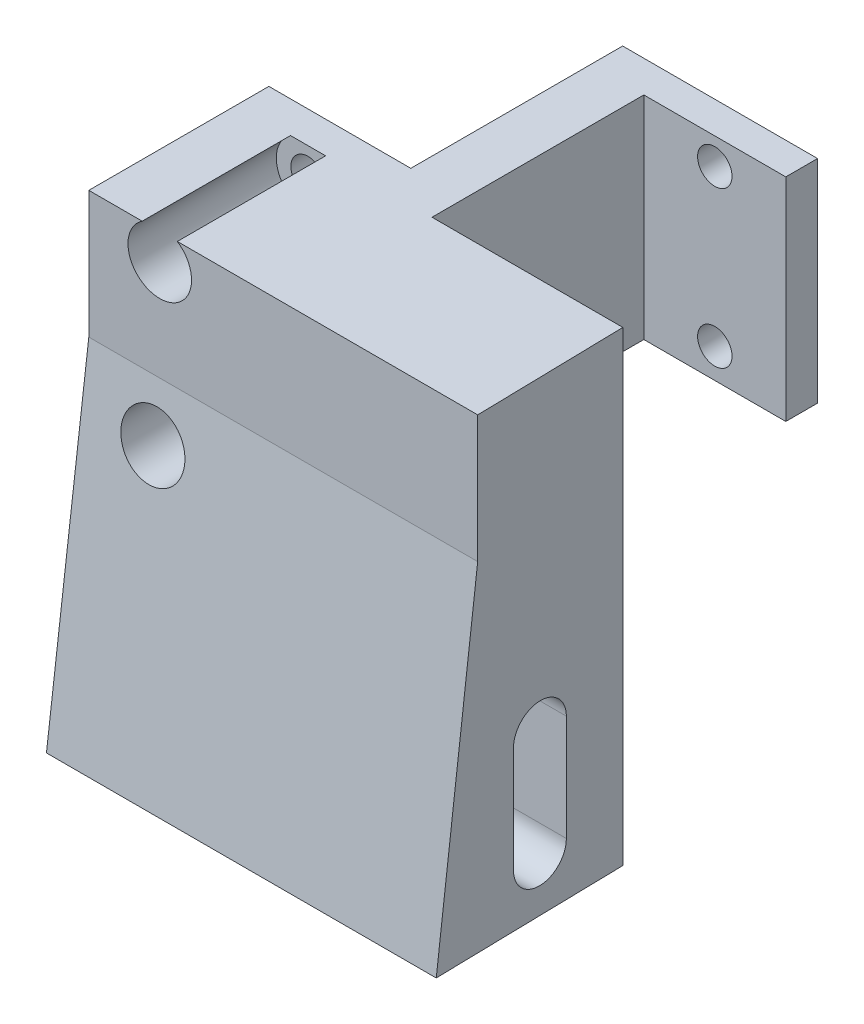
ISO-10303-21;
HEADER;
FILE_DESCRIPTION(('STEP AP214'),'2;1');
FILE_NAME('part.step','',(''),(''),'','','');
FILE_SCHEMA(('AUTOMOTIVE_DESIGN { 1 0 10303 214 1 1 1 1 }'));
ENDSEC;
DATA;
#1=APPLICATION_CONTEXT('core data for automotive mechanical design processes');
#2=APPLICATION_PROTOCOL_DEFINITION('international standard','automotive_design',2000,#1);
#3=PRODUCT_CONTEXT('',#1,'mechanical');
#4=PRODUCT('Part','Part','',(#3));
#5=PRODUCT_RELATED_PRODUCT_CATEGORY('part','',(#4));
#6=PRODUCT_DEFINITION_FORMATION('','',#4);
#7=PRODUCT_DEFINITION_CONTEXT('part definition',#1,'design');
#8=PRODUCT_DEFINITION('design','',#6,#7);
#9=PRODUCT_DEFINITION_SHAPE('','',#8);
#10=(LENGTH_UNIT() NAMED_UNIT(*) SI_UNIT(.MILLI.,.METRE.));
#11=(NAMED_UNIT(*) PLANE_ANGLE_UNIT() SI_UNIT($,.RADIAN.));
#12=(NAMED_UNIT(*) SI_UNIT($,.STERADIAN.) SOLID_ANGLE_UNIT());
#13=UNCERTAINTY_MEASURE_WITH_UNIT(LENGTH_MEASURE(1.E-05),#10,'distance_accuracy_value','');
#14=(GEOMETRIC_REPRESENTATION_CONTEXT(3) GLOBAL_UNCERTAINTY_ASSIGNED_CONTEXT((#13)) GLOBAL_UNIT_ASSIGNED_CONTEXT((#10,
#11,#12)) REPRESENTATION_CONTEXT('',''));
#15=CARTESIAN_POINT('',(0.,0.,0.));
#16=DIRECTION('',(0.,0.,1.));
#17=DIRECTION('',(1.,0.,0.));
#18=AXIS2_PLACEMENT_3D('',#15,#16,#17);
#19=CARTESIAN_POINT('',(89.3394572960189,-9.,7.99999999999999));
#20=DIRECTION('',(-1.,0.,0.));
#21=DIRECTION('',(0.,0.,1.));
#22=AXIS2_PLACEMENT_3D('',#19,#20,#21);
#23=CYLINDRICAL_SURFACE('',#22,2.55);
#24=CARTESIAN_POINT('',(31.5859039495124,-9.,8.));
#25=DIRECTION('',(-0.999773312281266,0.,0.021291407894867));
#26=DIRECTION('',(-0.021291407894867,0.,-0.999773312281266));
#27=AXIS2_PLACEMENT_3D('',#24,#25,#26);
#28=ELLIPSE('',#27,2.55057818475015,2.55);
#29=CARTESIAN_POINT('',(31.5315985490131,-9.,5.45));
#30=VERTEX_POINT('',#29);
#31=CARTESIAN_POINT('',(31.6402093500117,-9.,10.55));
#32=VERTEX_POINT('',#31);
#33=EDGE_CURVE('E371',#30,#32,#28,.F.);
#34=ORIENTED_EDGE('',*,*,#33,.F.);
#35=DIRECTION('',(-1.,0.,0.));
#36=VECTOR('',#35,1.);
#37=CARTESIAN_POINT('',(89.3394572960189,-9.,5.45));
#38=LINE('',#37,#36);
#39=CARTESIAN_POINT('',(36.5327322446017,-9.,5.45));
#40=VERTEX_POINT('',#39);
#41=EDGE_CURVE('E326',#40,#30,#38,.T.);
#42=ORIENTED_EDGE('',*,*,#41,.F.);
#43=CARTESIAN_POINT('',(36.5870376451009,-9.,8.));
#44=DIRECTION('',(-0.999773312281266,0.,0.021291407894867));
#45=DIRECTION('',(-0.021291407894867,0.,-0.999773312281266));
#46=AXIS2_PLACEMENT_3D('',#43,#44,#45);
#47=ELLIPSE('',#46,2.55057818475015,2.55);
#48=CARTESIAN_POINT('',(36.6413430456002,-9.,10.55));
#49=VERTEX_POINT('',#48);
#50=EDGE_CURVE('E331',#40,#49,#47,.F.);
#51=ORIENTED_EDGE('',*,*,#50,.T.);
#52=DIRECTION('',(-1.,0.,0.));
#53=VECTOR('',#52,1.);
#54=CARTESIAN_POINT('',(89.3394572960189,-9.,10.55));
#55=LINE('',#54,#53);
#56=EDGE_CURVE('E325',#49,#32,#55,.T.);
#57=ORIENTED_EDGE('',*,*,#56,.T.);
#58=EDGE_LOOP('',(#34,#42,#51,#57));
#59=FACE_BOUND('',#58,.T.);
#60=ADVANCED_FACE('F45',(#59),#23,.F.);
#61=CARTESIAN_POINT('',(89.3394572960189,-9.,10.55));
#62=DIRECTION('',(0.,0.,1.));
#63=DIRECTION('',(0.,-1.,0.));
#64=AXIS2_PLACEMENT_3D('',#61,#62,#63);
#65=PLANE('',#64);
#66=DIRECTION('',(0.,-1.,0.));
#67=VECTOR('',#66,1.);
#68=CARTESIAN_POINT('',(31.6402093500117,-9.,10.55));
#69=LINE('',#68,#67);
#70=CARTESIAN_POINT('',(31.6402093500117,-19.,10.55));
#71=VERTEX_POINT('',#70);
#72=EDGE_CURVE('E377',#32,#71,#69,.T.);
#73=ORIENTED_EDGE('',*,*,#72,.F.);
#74=ORIENTED_EDGE('',*,*,#56,.F.);
#75=DIRECTION('',(0.,-1.,0.));
#76=VECTOR('',#75,1.);
#77=CARTESIAN_POINT('',(36.6413430456002,-9.,10.55));
#78=LINE('',#77,#76);
#79=CARTESIAN_POINT('',(36.6413430456002,-19.,10.55));
#80=VERTEX_POINT('',#79);
#81=EDGE_CURVE('E345',#49,#80,#78,.T.);
#82=ORIENTED_EDGE('',*,*,#81,.T.);
#83=DIRECTION('',(-1.,0.,0.));
#84=VECTOR('',#83,1.);
#85=CARTESIAN_POINT('',(89.3394572960189,-19.,10.55));
#86=LINE('',#85,#84);
#87=EDGE_CURVE('E335',#80,#71,#86,.T.);
#88=ORIENTED_EDGE('',*,*,#87,.T.);
#89=EDGE_LOOP('',(#73,#74,#82,#88));
#90=FACE_BOUND('',#89,.T.);
#91=ADVANCED_FACE('F546',(#90),#65,.F.);
#92=CARTESIAN_POINT('',(89.3394572960189,-19.,8.));
#93=DIRECTION('',(-1.,0.,0.));
#94=DIRECTION('',(0.,0.,1.));
#95=AXIS2_PLACEMENT_3D('',#92,#93,#94);
#96=CYLINDRICAL_SURFACE('',#95,2.55);
#97=CARTESIAN_POINT('',(31.5859039495124,-19.,8.));
#98=DIRECTION('',(-0.999773312281266,0.,0.021291407894867));
#99=DIRECTION('',(-0.021291407894867,0.,-0.999773312281266));
#100=AXIS2_PLACEMENT_3D('',#97,#98,#99);
#101=ELLIPSE('',#100,2.55057818475015,2.55);
#102=CARTESIAN_POINT('',(31.5315985490131,-19.,5.45));
#103=VERTEX_POINT('',#102);
#104=EDGE_CURVE('E380',#71,#103,#101,.F.);
#105=ORIENTED_EDGE('',*,*,#104,.F.);
#106=ORIENTED_EDGE('',*,*,#87,.F.);
#107=CARTESIAN_POINT('',(36.5870376451009,-19.,8.));
#108=DIRECTION('',(-0.999773312281266,0.,0.021291407894867));
#109=DIRECTION('',(-0.021291407894867,0.,-0.999773312281266));
#110=AXIS2_PLACEMENT_3D('',#107,#108,#109);
#111=ELLIPSE('',#110,2.55057818475015,2.55);
#112=CARTESIAN_POINT('',(36.5327322446017,-19.,5.45));
#113=VERTEX_POINT('',#112);
#114=EDGE_CURVE('E349',#80,#113,#111,.F.);
#115=ORIENTED_EDGE('',*,*,#114,.T.);
#116=DIRECTION('',(-1.,0.,0.));
#117=VECTOR('',#116,1.);
#118=CARTESIAN_POINT('',(89.3394572960189,-19.,5.44999999999999));
#119=LINE('',#118,#117);
#120=EDGE_CURVE('E330',#113,#103,#119,.T.);
#121=ORIENTED_EDGE('',*,*,#120,.T.);
#122=EDGE_LOOP('',(#105,#106,#115,#121));
#123=FACE_BOUND('',#122,.T.);
#124=ADVANCED_FACE('F552',(#123),#96,.F.);
#125=CARTESIAN_POINT('',(89.3394572960189,-9.,5.45));
#126=DIRECTION('',(0.,0.,-1.));
#127=DIRECTION('',(0.,1.,0.));
#128=AXIS2_PLACEMENT_3D('',#125,#126,#127);
#129=PLANE('',#128);
#130=DIRECTION('',(0.,1.,0.));
#131=VECTOR('',#130,1.);
#132=CARTESIAN_POINT('',(31.5315985490131,-9.,5.45));
#133=LINE('',#132,#131);
#134=EDGE_CURVE('E383',#103,#30,#133,.T.);
#135=ORIENTED_EDGE('',*,*,#134,.F.);
#136=ORIENTED_EDGE('',*,*,#120,.F.);
#137=DIRECTION('',(0.,1.,0.));
#138=VECTOR('',#137,1.);
#139=CARTESIAN_POINT('',(36.5327322446017,-9.,5.45));
#140=LINE('',#139,#138);
#141=EDGE_CURVE('E353',#113,#40,#140,.T.);
#142=ORIENTED_EDGE('',*,*,#141,.T.);
#143=ORIENTED_EDGE('',*,*,#41,.T.);
#144=EDGE_LOOP('',(#135,#136,#142,#143));
#145=FACE_BOUND('',#144,.T.);
#146=ADVANCED_FACE('F558',(#145),#129,.F.);
#147=CARTESIAN_POINT('',(0.,20.,-3.));
#148=DIRECTION('',(1.,0.,0.));
#149=DIRECTION('',(0.,0.,-1.));
#150=AXIS2_PLACEMENT_3D('',#147,#148,#149);
#151=PLANE('',#150);
#152=CARTESIAN_POINT('',(0.,-9.,8.));
#153=DIRECTION('',(-1.,0.,0.));
#154=DIRECTION('',(0.,0.,1.));
#155=AXIS2_PLACEMENT_3D('',#152,#153,#154);
#156=CIRCLE('',#155,6.);
#157=CARTESIAN_POINT('',(0.,-9.,14.));
#158=VERTEX_POINT('',#157);
#159=CARTESIAN_POINT('',(0.,-9.,2.));
#160=VERTEX_POINT('',#159);
#161=EDGE_CURVE('E285',#158,#160,#156,.T.);
#162=ORIENTED_EDGE('',*,*,#161,.F.);
#163=DIRECTION('',(0.,1.,0.));
#164=VECTOR('',#163,1.);
#165=CARTESIAN_POINT('',(0.,-9.,14.));
#166=LINE('',#165,#164);
#167=CARTESIAN_POINT('',(0.,-24.,14.));
#168=VERTEX_POINT('',#167);
#169=EDGE_CURVE('E394',#168,#158,#166,.T.);
#170=ORIENTED_EDGE('',*,*,#169,.F.);
#171=DIRECTION('',(0.,0.,1.));
#172=VECTOR('',#171,1.);
#173=CARTESIAN_POINT('',(0.,-24.,0.));
#174=LINE('',#173,#172);
#175=CARTESIAN_POINT('',(0.,-24.,18.));
#176=VERTEX_POINT('',#175);
#177=EDGE_CURVE('E322',#168,#176,#174,.T.);
#178=ORIENTED_EDGE('',*,*,#177,.T.);
#179=DIRECTION('',(0.,0.992277876713668,-0.124034734589209));
#180=VECTOR('',#179,1.);
#181=CARTESIAN_POINT('',(0.,-24.,18.));
#182=LINE('',#181,#180);
#183=CARTESIAN_POINT('',(0.,8.,14.));
#184=VERTEX_POINT('',#183);
#185=EDGE_CURVE('E314',#176,#184,#182,.T.);
#186=ORIENTED_EDGE('',*,*,#185,.T.);
#187=DIRECTION('',(0.,1.,0.));
#188=VECTOR('',#187,1.);
#189=CARTESIAN_POINT('',(0.,8.,14.));
#190=LINE('',#189,#188);
#191=CARTESIAN_POINT('',(0.,20.,14.));
#192=VERTEX_POINT('',#191);
#193=EDGE_CURVE('E295',#184,#192,#190,.T.);
#194=ORIENTED_EDGE('',*,*,#193,.T.);
#195=DIRECTION('',(0.,0.,1.));
#196=VECTOR('',#195,1.);
#197=CARTESIAN_POINT('',(0.,20.,-3.));
#198=LINE('',#197,#196);
#199=CARTESIAN_POINT('',(0.,20.,-3.));
#200=VERTEX_POINT('',#199);
#201=EDGE_CURVE('E264',#200,#192,#198,.T.);
#202=ORIENTED_EDGE('',*,*,#201,.F.);
#203=DIRECTION('',(0.,-1.,0.));
#204=VECTOR('',#203,1.);
#205=CARTESIAN_POINT('',(0.,20.,-3.));
#206=LINE('',#205,#204);
#207=CARTESIAN_POINT('',(0.,0.,-3.));
#208=VERTEX_POINT('',#207);
#209=EDGE_CURVE('E248',#200,#208,#206,.T.);
#210=ORIENTED_EDGE('',*,*,#209,.T.);
#211=DIRECTION('',(0.,0.,1.));
#212=VECTOR('',#211,1.);
#213=CARTESIAN_POINT('',(0.,0.,-3.));
#214=LINE('',#213,#212);
#215=CARTESIAN_POINT('',(0.,0.,0.));
#216=VERTEX_POINT('',#215);
#217=EDGE_CURVE('E233',#208,#216,#214,.T.);
#218=ORIENTED_EDGE('',*,*,#217,.T.);
#219=DIRECTION('',(0.,-1.,0.));
#220=VECTOR('',#219,1.);
#221=CARTESIAN_POINT('',(0.,0.,0.));
#222=LINE('',#221,#220);
#223=CARTESIAN_POINT('',(0.,-24.,0.));
#224=VERTEX_POINT('',#223);
#225=EDGE_CURVE('E225',#216,#224,#222,.T.);
#226=ORIENTED_EDGE('',*,*,#225,.T.);
#227=CARTESIAN_POINT('',(0.,-24.,2.));
#228=VERTEX_POINT('',#227);
#229=EDGE_CURVE('E318',#224,#228,#174,.T.);
#230=ORIENTED_EDGE('',*,*,#229,.T.);
#231=DIRECTION('',(0.,-1.,0.));
#232=VECTOR('',#231,1.);
#233=CARTESIAN_POINT('',(0.,-24.,2.));
#234=LINE('',#233,#232);
#235=EDGE_CURVE('E408',#160,#228,#234,.T.);
#236=ORIENTED_EDGE('',*,*,#235,.F.);
#237=EDGE_LOOP('',(#162,#170,#178,#186,#194,#202,#210,#218,#226,#230,#236));
#238=FACE_BOUND('',#237,.T.);
#239=ADVANCED_FACE('F47',(#238),#151,.F.);
#240=CARTESIAN_POINT('',(18.4,20.,0.));
#241=DIRECTION('',(-1.,0.,0.));
#242=DIRECTION('',(0.,0.,1.));
#243=AXIS2_PLACEMENT_3D('',#240,#241,#242);
#244=PLANE('',#243);
#245=DIRECTION('',(0.,0.,-1.));
#246=VECTOR('',#245,1.);
#247=CARTESIAN_POINT('',(18.4,0.,0.));
#248=LINE('',#247,#246);
#249=CARTESIAN_POINT('',(18.4,0.,0.));
#250=VERTEX_POINT('',#249);
#251=CARTESIAN_POINT('',(18.4,0.,-20.));
#252=VERTEX_POINT('',#251);
#253=EDGE_CURVE('E227',#250,#252,#248,.T.);
#254=ORIENTED_EDGE('',*,*,#253,.T.);
#255=DIRECTION('',(0.,-1.,0.));
#256=VECTOR('',#255,1.);
#257=CARTESIAN_POINT('',(18.4,20.,-20.));
#258=LINE('',#257,#256);
#259=CARTESIAN_POINT('',(18.4,20.,-20.));
#260=VERTEX_POINT('',#259);
#261=EDGE_CURVE('E491',#260,#252,#258,.T.);
#262=ORIENTED_EDGE('',*,*,#261,.F.);
#263=DIRECTION('',(0.,0.,-1.));
#264=VECTOR('',#263,1.);
#265=CARTESIAN_POINT('',(18.4,20.,0.));
#266=LINE('',#265,#264);
#267=CARTESIAN_POINT('',(18.4,20.,0.));
#268=VERTEX_POINT('',#267);
#269=EDGE_CURVE('E261',#268,#260,#266,.T.);
#270=ORIENTED_EDGE('',*,*,#269,.F.);
#271=DIRECTION('',(0.,-1.,0.));
#272=VECTOR('',#271,1.);
#273=CARTESIAN_POINT('',(18.4,20.,0.));
#274=LINE('',#273,#272);
#275=EDGE_CURVE('E495',#268,#250,#274,.T.);
#276=ORIENTED_EDGE('',*,*,#275,.T.);
#277=EDGE_LOOP('',(#254,#262,#270,#276));
#278=FACE_BOUND('',#277,.T.);
#279=ADVANCED_FACE('F512',(#278),#244,.F.);
#280=CARTESIAN_POINT('',(18.4,20.,-20.));
#281=DIRECTION('',(0.,0.,-1.));
#282=DIRECTION('',(-1.,0.,0.));
#283=AXIS2_PLACEMENT_3D('',#280,#281,#282);
#284=PLANE('',#283);
#285=CARTESIAN_POINT('',(25.1,2.8,-20.));
#286=DIRECTION('',(0.,0.,-1.));
#287=DIRECTION('',(-1.,0.,0.));
#288=AXIS2_PLACEMENT_3D('',#285,#286,#287);
#289=CIRCLE('',#288,1.625);
#290=CARTESIAN_POINT('',(23.475,2.8,-20.));
#291=VERTEX_POINT('',#290);
#292=EDGE_CURVE('E237',#291,#291,#289,.T.);
#293=ORIENTED_EDGE('',*,*,#292,.T.);
#294=EDGE_LOOP('',(#293));
#295=FACE_BOUND('',#294,.T.);
#296=CARTESIAN_POINT('',(25.1,17.5,-20.));
#297=DIRECTION('',(0.,0.,-1.));
#298=DIRECTION('',(-1.,0.,0.));
#299=AXIS2_PLACEMENT_3D('',#296,#297,#298);
#300=CIRCLE('',#299,1.625);
#301=CARTESIAN_POINT('',(23.475,17.5,-20.));
#302=VERTEX_POINT('',#301);
#303=EDGE_CURVE('E242',#302,#302,#300,.T.);
#304=ORIENTED_EDGE('',*,*,#303,.T.);
#305=EDGE_LOOP('',(#304));
#306=FACE_BOUND('',#305,.T.);
#307=DIRECTION('',(1.,0.,0.));
#308=VECTOR('',#307,1.);
#309=CARTESIAN_POINT('',(18.4,0.,-20.));
#310=LINE('',#309,#308);
#311=CARTESIAN_POINT('',(31.8,0.,-20.));
#312=VERTEX_POINT('',#311);
#313=EDGE_CURVE('E229',#252,#312,#310,.T.);
#314=ORIENTED_EDGE('',*,*,#313,.T.);
#315=DIRECTION('',(0.,-1.,0.));
#316=VECTOR('',#315,1.);
#317=CARTESIAN_POINT('',(31.8,20.,-20.));
#318=LINE('',#317,#316);
#319=CARTESIAN_POINT('',(31.8,20.,-20.));
#320=VERTEX_POINT('',#319);
#321=EDGE_CURVE('E487',#320,#312,#318,.T.);
#322=ORIENTED_EDGE('',*,*,#321,.F.);
#323=DIRECTION('',(1.,0.,0.));
#324=VECTOR('',#323,1.);
#325=CARTESIAN_POINT('',(18.4,20.,-20.));
#326=LINE('',#325,#324);
#327=EDGE_CURVE('E258',#260,#320,#326,.T.);
#328=ORIENTED_EDGE('',*,*,#327,.F.);
#329=ORIENTED_EDGE('',*,*,#261,.T.);
#330=EDGE_LOOP('',(#314,#322,#328,#329));
#331=FACE_BOUND('',#330,.T.);
#332=ADVANCED_FACE('F518',(#295,#306,#331),#284,.F.);
#333=CARTESIAN_POINT('',(31.8,20.,-20.));
#334=DIRECTION('',(-1.,0.,0.));
#335=DIRECTION('',(0.,0.,1.));
#336=AXIS2_PLACEMENT_3D('',#333,#334,#335);
#337=PLANE('',#336);
#338=DIRECTION('',(0.,0.,-1.));
#339=VECTOR('',#338,1.);
#340=CARTESIAN_POINT('',(31.8,0.,-20.));
#341=LINE('',#340,#339);
#342=CARTESIAN_POINT('',(31.8,0.,-23.));
#343=VERTEX_POINT('',#342);
#344=EDGE_CURVE('E524',#312,#343,#341,.T.);
#345=ORIENTED_EDGE('',*,*,#344,.T.);
#346=DIRECTION('',(0.,-1.,0.));
#347=VECTOR('',#346,1.);
#348=CARTESIAN_POINT('',(31.8,20.,-23.));
#349=LINE('',#348,#347);
#350=CARTESIAN_POINT('',(31.8,20.,-23.));
#351=VERTEX_POINT('',#350);
#352=EDGE_CURVE('E483',#351,#343,#349,.T.);
#353=ORIENTED_EDGE('',*,*,#352,.F.);
#354=DIRECTION('',(0.,0.,-1.));
#355=VECTOR('',#354,1.);
#356=CARTESIAN_POINT('',(31.8,20.,-20.));
#357=LINE('',#356,#355);
#358=EDGE_CURVE('E255',#320,#351,#357,.T.);
#359=ORIENTED_EDGE('',*,*,#358,.F.);
#360=ORIENTED_EDGE('',*,*,#321,.T.);
#361=EDGE_LOOP('',(#345,#353,#359,#360));
#362=FACE_BOUND('',#361,.T.);
#363=ADVANCED_FACE('F522',(#362),#337,.F.);
#364=CARTESIAN_POINT('',(31.8,20.,-23.));
#365=DIRECTION('',(0.,0.,1.));
#366=DIRECTION('',(1.,0.,0.));
#367=AXIS2_PLACEMENT_3D('',#364,#365,#366);
#368=PLANE('',#367);
#369=CARTESIAN_POINT('',(25.1,2.8,-23.));
#370=DIRECTION('',(0.,0.,1.));
#371=DIRECTION('',(1.,0.,0.));
#372=AXIS2_PLACEMENT_3D('',#369,#370,#371);
#373=CIRCLE('',#372,1.625);
#374=CARTESIAN_POINT('',(26.725,2.8,-23.));
#375=VERTEX_POINT('',#374);
#376=EDGE_CURVE('E272',#375,#375,#373,.T.);
#377=ORIENTED_EDGE('',*,*,#376,.T.);
#378=EDGE_LOOP('',(#377));
#379=FACE_BOUND('',#378,.T.);
#380=CARTESIAN_POINT('',(25.1,17.5,-23.));
#381=DIRECTION('',(0.,0.,1.));
#382=DIRECTION('',(1.,0.,0.));
#383=AXIS2_PLACEMENT_3D('',#380,#381,#382);
#384=CIRCLE('',#383,1.625);
#385=CARTESIAN_POINT('',(26.725,17.5,-23.));
#386=VERTEX_POINT('',#385);
#387=EDGE_CURVE('E273',#386,#386,#384,.T.);
#388=ORIENTED_EDGE('',*,*,#387,.T.);
#389=EDGE_LOOP('',(#388));
#390=FACE_BOUND('',#389,.T.);
#391=DIRECTION('',(-1.,0.,0.));
#392=VECTOR('',#391,1.);
#393=CARTESIAN_POINT('',(31.8,0.,-23.));
#394=LINE('',#393,#392);
#395=CARTESIAN_POINT('',(13.4,0.,-23.));
#396=VERTEX_POINT('',#395);
#397=EDGE_CURVE('E473',#343,#396,#394,.T.);
#398=ORIENTED_EDGE('',*,*,#397,.T.);
#399=DIRECTION('',(0.,-1.,0.));
#400=VECTOR('',#399,1.);
#401=CARTESIAN_POINT('',(13.4,20.,-23.));
#402=LINE('',#401,#400);
#403=CARTESIAN_POINT('',(13.4,20.,-23.));
#404=VERTEX_POINT('',#403);
#405=EDGE_CURVE('E479',#404,#396,#402,.T.);
#406=ORIENTED_EDGE('',*,*,#405,.F.);
#407=DIRECTION('',(-1.,0.,0.));
#408=VECTOR('',#407,1.);
#409=CARTESIAN_POINT('',(31.8,20.,-23.));
#410=LINE('',#409,#408);
#411=EDGE_CURVE('E252',#351,#404,#410,.T.);
#412=ORIENTED_EDGE('',*,*,#411,.F.);
#413=ORIENTED_EDGE('',*,*,#352,.T.);
#414=EDGE_LOOP('',(#398,#406,#412,#413));
#415=FACE_BOUND('',#414,.T.);
#416=ADVANCED_FACE('F527',(#379,#390,#415),#368,.F.);
#417=CARTESIAN_POINT('',(13.4,20.,-23.));
#418=DIRECTION('',(1.,0.,0.));
#419=DIRECTION('',(0.,0.,-1.));
#420=AXIS2_PLACEMENT_3D('',#417,#418,#419);
#421=PLANE('',#420);
#422=DIRECTION('',(0.,0.,1.));
#423=VECTOR('',#422,1.);
#424=CARTESIAN_POINT('',(13.4,0.,-23.));
#425=LINE('',#424,#423);
#426=CARTESIAN_POINT('',(13.4,0.,-3.));
#427=VERTEX_POINT('',#426);
#428=EDGE_CURVE('E468',#396,#427,#425,.T.);
#429=ORIENTED_EDGE('',*,*,#428,.T.);
#430=DIRECTION('',(0.,-1.,0.));
#431=VECTOR('',#430,1.);
#432=CARTESIAN_POINT('',(13.4,20.,-3.));
#433=LINE('',#432,#431);
#434=CARTESIAN_POINT('',(13.4,20.,-3.));
#435=VERTEX_POINT('',#434);
#436=EDGE_CURVE('E463',#435,#427,#433,.T.);
#437=ORIENTED_EDGE('',*,*,#436,.F.);
#438=DIRECTION('',(0.,0.,1.));
#439=VECTOR('',#438,1.);
#440=CARTESIAN_POINT('',(13.4,20.,-23.));
#441=LINE('',#440,#439);
#442=EDGE_CURVE('E249',#404,#435,#441,.T.);
#443=ORIENTED_EDGE('',*,*,#442,.F.);
#444=ORIENTED_EDGE('',*,*,#405,.T.);
#445=EDGE_LOOP('',(#429,#437,#443,#444));
#446=FACE_BOUND('',#445,.T.);
#447=ADVANCED_FACE('F531',(#446),#421,.F.);
#448=CARTESIAN_POINT('',(13.4,20.,-3.));
#449=DIRECTION('',(0.,0.,1.));
#450=DIRECTION('',(1.,0.,0.));
#451=AXIS2_PLACEMENT_3D('',#448,#449,#450);
#452=PLANE('',#451);
#453=CARTESIAN_POINT('',(6.69999999999999,2.8,-3.));
#454=DIRECTION('',(0.,0.,1.));
#455=DIRECTION('',(1.,0.,0.));
#456=AXIS2_PLACEMENT_3D('',#453,#454,#455);
#457=CIRCLE('',#456,1.625);
#458=CARTESIAN_POINT('',(8.32499999999999,2.8,-3.));
#459=VERTEX_POINT('',#458);
#460=EDGE_CURVE('E277',#459,#459,#457,.F.);
#461=ORIENTED_EDGE('',*,*,#460,.F.);
#462=EDGE_LOOP('',(#461));
#463=FACE_BOUND('',#462,.T.);
#464=CARTESIAN_POINT('',(6.69999999999999,17.5,-3.));
#465=DIRECTION('',(0.,0.,1.));
#466=DIRECTION('',(1.,0.,0.));
#467=AXIS2_PLACEMENT_3D('',#464,#465,#466);
#468=CIRCLE('',#467,1.625);
#469=CARTESIAN_POINT('',(8.32499999999999,17.5,-3.));
#470=VERTEX_POINT('',#469);
#471=EDGE_CURVE('E310',#470,#470,#468,.F.);
#472=ORIENTED_EDGE('',*,*,#471,.F.);
#473=EDGE_LOOP('',(#472));
#474=FACE_BOUND('',#473,.T.);
#475=DIRECTION('',(-1.,0.,0.));
#476=VECTOR('',#475,1.);
#477=CARTESIAN_POINT('',(13.4,0.,-3.));
#478=LINE('',#477,#476);
#479=EDGE_CURVE('E267',#427,#208,#478,.T.);
#480=ORIENTED_EDGE('',*,*,#479,.T.);
#481=ORIENTED_EDGE('',*,*,#209,.F.);
#482=DIRECTION('',(-1.,0.,0.));
#483=VECTOR('',#482,1.);
#484=CARTESIAN_POINT('',(13.4,20.,-3.));
#485=LINE('',#484,#483);
#486=EDGE_CURVE('E245',#435,#200,#485,.T.);
#487=ORIENTED_EDGE('',*,*,#486,.F.);
#488=ORIENTED_EDGE('',*,*,#436,.T.);
#489=EDGE_LOOP('',(#480,#481,#487,#488));
#490=FACE_BOUND('',#489,.T.);
#491=ADVANCED_FACE('F532',(#463,#474,#490),#452,.F.);
#492=CARTESIAN_POINT('',(0.,20.,0.));
#493=DIRECTION('',(0.,1.,0.));
#494=DIRECTION('',(0.,0.,1.));
#495=AXIS2_PLACEMENT_3D('',#492,#493,#494);
#496=PLANE('',#495);
#497=DIRECTION('',(0.,0.,-1.));
#498=VECTOR('',#497,1.);
#499=CARTESIAN_POINT('',(8.3583123951777,20.,18.));
#500=LINE('',#499,#498);
#501=CARTESIAN_POINT('',(8.3583123951777,20.,14.));
#502=VERTEX_POINT('',#501);
#503=CARTESIAN_POINT('',(8.35831239517769,20.,0.));
#504=VERTEX_POINT('',#503);
#505=EDGE_CURVE('E290',#502,#504,#500,.T.);
#506=ORIENTED_EDGE('',*,*,#505,.F.);
#507=DIRECTION('',(-1.,0.,0.));
#508=VECTOR('',#507,1.);
#509=CARTESIAN_POINT('',(89.3394572960189,20.,14.));
#510=LINE('',#509,#508);
#511=CARTESIAN_POINT('',(36.7148150580404,20.,14.));
#512=VERTEX_POINT('',#511);
#513=EDGE_CURVE('E303',#512,#502,#510,.T.);
#514=ORIENTED_EDGE('',*,*,#513,.F.);
#515=DIRECTION('',(-0.021291407894867,0.,-0.999773312281266));
#516=VECTOR('',#515,1.);
#517=CARTESIAN_POINT('',(36.8,20.,18.));
#518=LINE('',#517,#516);
#519=CARTESIAN_POINT('',(36.4166677611817,20.,0.));
#520=VERTEX_POINT('',#519);
#521=EDGE_CURVE('E367',#512,#520,#518,.T.);
#522=ORIENTED_EDGE('',*,*,#521,.T.);
#523=DIRECTION('',(-1.,0.,0.));
#524=VECTOR('',#523,1.);
#525=CARTESIAN_POINT('',(89.3394572960189,20.,0.));
#526=LINE('',#525,#524);
#527=EDGE_CURVE('E307',#520,#268,#526,.T.);
#528=ORIENTED_EDGE('',*,*,#527,.T.);
#529=ORIENTED_EDGE('',*,*,#269,.T.);
#530=ORIENTED_EDGE('',*,*,#327,.T.);
#531=ORIENTED_EDGE('',*,*,#358,.T.);
#532=ORIENTED_EDGE('',*,*,#411,.T.);
#533=ORIENTED_EDGE('',*,*,#442,.T.);
#534=ORIENTED_EDGE('',*,*,#486,.T.);
#535=ORIENTED_EDGE('',*,*,#201,.T.);
#536=CARTESIAN_POINT('',(5.04168760482228,20.,14.));
#537=VERTEX_POINT('',#536);
#538=EDGE_CURVE('E302',#537,#192,#510,.T.);
#539=ORIENTED_EDGE('',*,*,#538,.F.);
#540=DIRECTION('',(0.,0.,-1.));
#541=VECTOR('',#540,1.);
#542=CARTESIAN_POINT('',(5.04168760482228,20.,18.));
#543=LINE('',#542,#541);
#544=CARTESIAN_POINT('',(5.04168760482229,20.,0.));
#545=VERTEX_POINT('',#544);
#546=EDGE_CURVE('E61',#545,#537,#543,.F.);
#547=ORIENTED_EDGE('',*,*,#546,.F.);
#548=DIRECTION('',(-1.,0.,0.));
#549=VECTOR('',#548,1.);
#550=CARTESIAN_POINT('',(0.,20.,0.));
#551=LINE('',#550,#549);
#552=EDGE_CURVE('E12',#504,#545,#551,.T.);
#553=ORIENTED_EDGE('',*,*,#552,.F.);
#554=EDGE_LOOP('',(#506,#514,#522,#528,#529,#530,#531,#532,#533,#534,#535,#539,#547,#553));
#555=FACE_BOUND('',#554,.T.);
#556=ADVANCED_FACE('F437',(#555),#496,.T.);
#557=CARTESIAN_POINT('',(0.,0.,0.));
#558=DIRECTION('',(0.,1.,0.));
#559=DIRECTION('',(0.,0.,1.));
#560=AXIS2_PLACEMENT_3D('',#557,#558,#559);
#561=PLANE('',#560);
#562=ORIENTED_EDGE('',*,*,#217,.F.);
#563=ORIENTED_EDGE('',*,*,#479,.F.);
#564=ORIENTED_EDGE('',*,*,#428,.F.);
#565=ORIENTED_EDGE('',*,*,#397,.F.);
#566=ORIENTED_EDGE('',*,*,#344,.F.);
#567=ORIENTED_EDGE('',*,*,#313,.F.);
#568=ORIENTED_EDGE('',*,*,#253,.F.);
#569=DIRECTION('',(1.,0.,0.));
#570=VECTOR('',#569,1.);
#571=CARTESIAN_POINT('',(0.,0.,0.));
#572=LINE('',#571,#570);
#573=CARTESIAN_POINT('',(7.77703296142688,0.,0.));
#574=VERTEX_POINT('',#573);
#575=EDGE_CURVE('E220',#574,#250,#572,.T.);
#576=ORIENTED_EDGE('',*,*,#575,.F.);
#577=CARTESIAN_POINT('',(5.62296703857309,0.,0.));
#578=VERTEX_POINT('',#577);
#579=EDGE_CURVE('E201',#578,#574,#572,.T.);
#580=ORIENTED_EDGE('',*,*,#579,.F.);
#581=EDGE_CURVE('E217',#216,#578,#572,.T.);
#582=ORIENTED_EDGE('',*,*,#581,.F.);
#583=EDGE_LOOP('',(#562,#563,#564,#565,#566,#567,#568,#576,#580,#582));
#584=FACE_BOUND('',#583,.T.);
#585=ADVANCED_FACE('F216',(#584),#561,.F.);
#586=CARTESIAN_POINT('',(25.1,17.5,-23.));
#587=DIRECTION('',(0.,0.,1.));
#588=DIRECTION('',(1.,0.,0.));
#589=AXIS2_PLACEMENT_3D('',#586,#587,#588);
#590=CYLINDRICAL_SURFACE('',#589,1.625);
#591=ORIENTED_EDGE('',*,*,#387,.F.);
#592=EDGE_LOOP('',(#591));
#593=FACE_BOUND('',#592,.T.);
#594=ORIENTED_EDGE('',*,*,#303,.F.);
#595=EDGE_LOOP('',(#594));
#596=FACE_BOUND('',#595,.T.);
#597=ADVANCED_FACE('F580',(#593,#596),#590,.F.);
#598=CARTESIAN_POINT('',(25.1,2.8,-23.));
#599=DIRECTION('',(0.,0.,1.));
#600=DIRECTION('',(1.,0.,0.));
#601=AXIS2_PLACEMENT_3D('',#598,#599,#600);
#602=CYLINDRICAL_SURFACE('',#601,1.625);
#603=ORIENTED_EDGE('',*,*,#376,.F.);
#604=EDGE_LOOP('',(#603));
#605=FACE_BOUND('',#604,.T.);
#606=ORIENTED_EDGE('',*,*,#292,.F.);
#607=EDGE_LOOP('',(#606));
#608=FACE_BOUND('',#607,.T.);
#609=ADVANCED_FACE('F576',(#605,#608),#602,.F.);
#610=CARTESIAN_POINT('',(6.69999999999999,17.5,-23.));
#611=DIRECTION('',(0.,0.,1.));
#612=DIRECTION('',(1.,0.,0.));
#613=AXIS2_PLACEMENT_3D('',#610,#611,#612);
#614=CYLINDRICAL_SURFACE('',#613,1.625);
#615=CARTESIAN_POINT('',(6.69999999999999,17.5,0.));
#616=DIRECTION('',(0.,0.,-1.));
#617=DIRECTION('',(-1.,0.,0.));
#618=AXIS2_PLACEMENT_3D('',#615,#616,#617);
#619=CIRCLE('',#618,1.625);
#620=CARTESIAN_POINT('',(5.07499999999999,17.5,0.));
#621=VERTEX_POINT('',#620);
#622=EDGE_CURVE('E281',#621,#621,#619,.T.);
#623=ORIENTED_EDGE('',*,*,#622,.F.);
#624=EDGE_LOOP('',(#623));
#625=FACE_BOUND('',#624,.T.);
#626=ORIENTED_EDGE('',*,*,#471,.T.);
#627=EDGE_LOOP('',(#626));
#628=FACE_BOUND('',#627,.T.);
#629=ADVANCED_FACE('F572',(#625,#628),#614,.F.);
#630=CARTESIAN_POINT('',(6.69999999999999,2.8,-23.));
#631=DIRECTION('',(0.,0.,1.));
#632=DIRECTION('',(1.,0.,0.));
#633=AXIS2_PLACEMENT_3D('',#630,#631,#632);
#634=CYLINDRICAL_SURFACE('',#633,1.625);
#635=CARTESIAN_POINT('',(6.69999999999999,2.8,0.));
#636=DIRECTION('',(0.,0.,-1.));
#637=DIRECTION('',(-1.,0.,0.));
#638=AXIS2_PLACEMENT_3D('',#635,#636,#637);
#639=CIRCLE('',#638,1.625);
#640=CARTESIAN_POINT('',(5.07499999999999,2.8,0.));
#641=VERTEX_POINT('',#640);
#642=EDGE_CURVE('E286',#641,#641,#639,.T.);
#643=ORIENTED_EDGE('',*,*,#642,.F.);
#644=EDGE_LOOP('',(#643));
#645=FACE_BOUND('',#644,.T.);
#646=ORIENTED_EDGE('',*,*,#460,.T.);
#647=EDGE_LOOP('',(#646));
#648=FACE_BOUND('',#647,.T.);
#649=ADVANCED_FACE('F562',(#645,#648),#634,.F.);
#650=CARTESIAN_POINT('',(89.3394572960189,8.,14.));
#651=DIRECTION('',(0.,0.,1.));
#652=DIRECTION('',(1.,0.,0.));
#653=AXIS2_PLACEMENT_3D('',#650,#651,#652);
#654=PLANE('',#653);
#655=CARTESIAN_POINT('',(6.69999999999999,17.5,14.));
#656=DIRECTION('',(0.,0.,1.));
#657=DIRECTION('',(1.,0.,0.));
#658=AXIS2_PLACEMENT_3D('',#655,#656,#657);
#659=CIRCLE('',#658,3.);
#660=EDGE_CURVE('E54',#537,#502,#659,.T.);
#661=ORIENTED_EDGE('',*,*,#660,.F.);
#662=ORIENTED_EDGE('',*,*,#538,.T.);
#663=ORIENTED_EDGE('',*,*,#193,.F.);
#664=DIRECTION('',(-1.,0.,0.));
#665=VECTOR('',#664,1.);
#666=CARTESIAN_POINT('',(89.3394572960189,8.,14.));
#667=LINE('',#666,#665);
#668=CARTESIAN_POINT('',(36.7148150580404,8.,14.));
#669=VERTEX_POINT('',#668);
#670=EDGE_CURVE('E299',#669,#184,#667,.T.);
#671=ORIENTED_EDGE('',*,*,#670,.F.);
#672=DIRECTION('',(0.,-1.,0.));
#673=VECTOR('',#672,1.);
#674=CARTESIAN_POINT('',(36.7148150580404,8.,14.));
#675=LINE('',#674,#673);
#676=EDGE_CURVE('E357',#512,#669,#675,.T.);
#677=ORIENTED_EDGE('',*,*,#676,.F.);
#678=ORIENTED_EDGE('',*,*,#513,.T.);
#679=EDGE_LOOP('',(#661,#662,#663,#671,#677,#678));
#680=FACE_BOUND('',#679,.T.);
#681=ADVANCED_FACE('F458',(#680),#654,.T.);
#682=CARTESIAN_POINT('',(89.3394572960189,-24.,18.));
#683=DIRECTION('',(0.,0.124034734589209,0.992277876713668));
#684=DIRECTION('',(0.,-0.992277876713668,0.124034734589209));
#685=AXIS2_PLACEMENT_3D('',#682,#683,#684);
#686=PLANE('',#685);
#687=CARTESIAN_POINT('',(6.69999999999999,2.8,14.65));
#688=DIRECTION('',(0.,0.124034734589209,0.992277876713668));
#689=DIRECTION('',(0.,0.992277876713668,-0.124034734589209));
#690=AXIS2_PLACEMENT_3D('',#687,#688,#689);
#691=ELLIPSE('',#690,3.02334665561196,3.);
#692=CARTESIAN_POINT('',(6.69999999999999,5.8,14.275));
#693=VERTEX_POINT('',#692);
#694=EDGE_CURVE('E212',#693,#693,#691,.T.);
#695=ORIENTED_EDGE('',*,*,#694,.F.);
#696=EDGE_LOOP('',(#695));
#697=FACE_BOUND('',#696,.T.);
#698=DIRECTION('',(0.00264146370150917,-0.992274414982289,0.124034301872786));
#699=VECTOR('',#698,1.);
#700=CARTESIAN_POINT('',(36.8003665851571,-24.1377089043944,18.0172136130493));
#701=LINE('',#700,#699);
#702=CARTESIAN_POINT('',(36.8,-24.,18.));
#703=VERTEX_POINT('',#702);
#704=EDGE_CURVE('E360',#669,#703,#701,.T.);
#705=ORIENTED_EDGE('',*,*,#704,.F.);
#706=ORIENTED_EDGE('',*,*,#670,.T.);
#707=ORIENTED_EDGE('',*,*,#185,.F.);
#708=DIRECTION('',(-1.,0.,0.));
#709=VECTOR('',#708,1.);
#710=CARTESIAN_POINT('',(89.3394572960189,-24.,18.));
#711=LINE('',#710,#709);
#712=EDGE_CURVE('E294',#703,#176,#711,.T.);
#713=ORIENTED_EDGE('',*,*,#712,.F.);
#714=EDGE_LOOP('',(#705,#706,#707,#713));
#715=FACE_BOUND('',#714,.T.);
#716=ADVANCED_FACE('F455',(#697,#715),#686,.T.);
#717=CARTESIAN_POINT('',(89.3394572960189,-24.,0.));
#718=DIRECTION('',(0.,-1.,0.));
#719=DIRECTION('',(0.,0.,-1.));
#720=AXIS2_PLACEMENT_3D('',#717,#718,#719);
#721=PLANE('',#720);
#722=DIRECTION('',(-1.,0.,0.));
#723=VECTOR('',#722,1.);
#724=CARTESIAN_POINT('',(60.7754192382209,-24.,14.));
#725=LINE('',#724,#723);
#726=CARTESIAN_POINT('',(31.7136813624518,-24.,14.));
#727=VERTEX_POINT('',#726);
#728=EDGE_CURVE('E398',#727,#168,#725,.T.);
#729=ORIENTED_EDGE('',*,*,#728,.F.);
#730=DIRECTION('',(-0.021291407894867,0.,-0.999773312281266));
#731=VECTOR('',#730,1.);
#732=CARTESIAN_POINT('',(31.7268557471699,-24.,14.618625048749));
#733=LINE('',#732,#731);
#734=CARTESIAN_POINT('',(31.4581265365729,-24.,2.));
#735=VERTEX_POINT('',#734);
#736=EDGE_CURVE('E404',#727,#735,#733,.T.);
#737=ORIENTED_EDGE('',*,*,#736,.T.);
#738=DIRECTION('',(-1.,0.,0.));
#739=VECTOR('',#738,1.);
#740=CARTESIAN_POINT('',(60.7754192382209,-24.,2.));
#741=LINE('',#740,#739);
#742=EDGE_CURVE('E393',#735,#228,#741,.T.);
#743=ORIENTED_EDGE('',*,*,#742,.T.);
#744=ORIENTED_EDGE('',*,*,#229,.F.);
#745=DIRECTION('',(-1.,0.,0.));
#746=VECTOR('',#745,1.);
#747=CARTESIAN_POINT('',(89.3394572960189,-24.,0.));
#748=LINE('',#747,#746);
#749=CARTESIAN_POINT('',(36.4166677611817,-24.,0.));
#750=VERTEX_POINT('',#749);
#751=EDGE_CURVE('E291',#750,#224,#748,.T.);
#752=ORIENTED_EDGE('',*,*,#751,.F.);
#753=DIRECTION('',(-0.021291407894867,0.,-0.999773312281266));
#754=VECTOR('',#753,1.);
#755=CARTESIAN_POINT('',(36.8,-24.,18.));
#756=LINE('',#755,#754);
#757=EDGE_CURVE('E368',#703,#750,#756,.T.);
#758=ORIENTED_EDGE('',*,*,#757,.F.);
#759=ORIENTED_EDGE('',*,*,#712,.T.);
#760=ORIENTED_EDGE('',*,*,#177,.F.);
#761=EDGE_LOOP('',(#729,#737,#743,#744,#752,#758,#759,#760));
#762=FACE_BOUND('',#761,.T.);
#763=ADVANCED_FACE('F451',(#762),#721,.T.);
#764=CARTESIAN_POINT('',(89.3394572960189,0.,0.));
#765=DIRECTION('',(0.,0.,-1.));
#766=DIRECTION('',(0.,1.,0.));
#767=AXIS2_PLACEMENT_3D('',#764,#765,#766);
#768=PLANE('',#767);
#769=CARTESIAN_POINT('',(6.69999999999999,2.8,0.));
#770=DIRECTION('',(0.,0.,-1.));
#771=DIRECTION('',(0.,1.,0.));
#772=AXIS2_PLACEMENT_3D('',#769,#770,#771);
#773=CIRCLE('',#772,3.);
#774=EDGE_CURVE('E204',#574,#578,#773,.T.);
#775=ORIENTED_EDGE('',*,*,#774,.F.);
#776=ORIENTED_EDGE('',*,*,#575,.T.);
#777=ORIENTED_EDGE('',*,*,#275,.F.);
#778=ORIENTED_EDGE('',*,*,#527,.F.);
#779=DIRECTION('',(0.,-1.,0.));
#780=VECTOR('',#779,1.);
#781=CARTESIAN_POINT('',(36.4166677611817,20.,0.));
#782=LINE('',#781,#780);
#783=EDGE_CURVE('E363',#520,#750,#782,.T.);
#784=ORIENTED_EDGE('',*,*,#783,.T.);
#785=ORIENTED_EDGE('',*,*,#751,.T.);
#786=ORIENTED_EDGE('',*,*,#225,.F.);
#787=ORIENTED_EDGE('',*,*,#581,.T.);
#788=EDGE_LOOP('',(#775,#776,#777,#778,#784,#785,#786,#787));
#789=FACE_BOUND('',#788,.T.);
#790=ADVANCED_FACE('F223',(#789),#768,.T.);
#791=CARTESIAN_POINT('',(36.8,20.,18.));
#792=DIRECTION('',(-0.999773312281266,0.,0.021291407894867));
#793=DIRECTION('',(0.021291407894867,0.,0.999773312281266));
#794=AXIS2_PLACEMENT_3D('',#791,#792,#793);
#795=PLANE('',#794);
#796=ORIENTED_EDGE('',*,*,#676,.T.);
#797=ORIENTED_EDGE('',*,*,#704,.T.);
#798=ORIENTED_EDGE('',*,*,#757,.T.);
#799=ORIENTED_EDGE('',*,*,#783,.F.);
#800=ORIENTED_EDGE('',*,*,#521,.F.);
#801=EDGE_LOOP('',(#796,#797,#798,#799,#800));
#802=FACE_BOUND('',#801,.T.);
#803=ORIENTED_EDGE('',*,*,#141,.F.);
#804=ORIENTED_EDGE('',*,*,#114,.F.);
#805=ORIENTED_EDGE('',*,*,#81,.F.);
#806=ORIENTED_EDGE('',*,*,#50,.F.);
#807=EDGE_LOOP('',(#803,#804,#805,#806));
#808=FACE_BOUND('',#807,.T.);
#809=ADVANCED_FACE('F506',(#802,#808),#795,.F.);
#810=CARTESIAN_POINT('',(31.8011334385937,20.,18.1064570394743));
#811=DIRECTION('',(-0.999773312281266,0.,0.021291407894867));
#812=DIRECTION('',(0.021291407894867,0.,0.999773312281266));
#813=AXIS2_PLACEMENT_3D('',#810,#811,#812);
#814=PLANE('',#813);
#815=CARTESIAN_POINT('',(31.5859039495124,-9.,8.));
#816=DIRECTION('',(-0.999773312281266,0.,0.021291407894867));
#817=DIRECTION('',(-0.021291407894867,0.,-0.999773312281266));
#818=AXIS2_PLACEMENT_3D('',#815,#816,#817);
#819=ELLIPSE('',#818,6.00136043470624,6.);
#820=CARTESIAN_POINT('',(31.4581265365729,-9.,2.));
#821=VERTEX_POINT('',#820);
#822=CARTESIAN_POINT('',(31.7136813624518,-9.,14.));
#823=VERTEX_POINT('',#822);
#824=EDGE_CURVE('E389',#821,#823,#819,.F.);
#825=ORIENTED_EDGE('',*,*,#824,.F.);
#826=DIRECTION('',(0.,1.,0.));
#827=VECTOR('',#826,1.);
#828=CARTESIAN_POINT('',(31.4581265365729,-24.,2.));
#829=LINE('',#828,#827);
#830=EDGE_CURVE('E386',#735,#821,#829,.T.);
#831=ORIENTED_EDGE('',*,*,#830,.F.);
#832=ORIENTED_EDGE('',*,*,#736,.F.);
#833=DIRECTION('',(0.,-1.,0.));
#834=VECTOR('',#833,1.);
#835=CARTESIAN_POINT('',(31.7136813624518,-9.,14.));
#836=LINE('',#835,#834);
#837=EDGE_CURVE('E416',#823,#727,#836,.T.);
#838=ORIENTED_EDGE('',*,*,#837,.F.);
#839=EDGE_LOOP('',(#825,#831,#832,#838));
#840=FACE_BOUND('',#839,.T.);
#841=ORIENTED_EDGE('',*,*,#33,.T.);
#842=ORIENTED_EDGE('',*,*,#72,.T.);
#843=ORIENTED_EDGE('',*,*,#104,.T.);
#844=ORIENTED_EDGE('',*,*,#134,.T.);
#845=EDGE_LOOP('',(#841,#842,#843,#844));
#846=FACE_BOUND('',#845,.T.);
#847=ADVANCED_FACE('F632',(#840,#846),#814,.T.);
#848=CARTESIAN_POINT('',(60.7754192382209,-9.,8.));
#849=DIRECTION('',(-1.,0.,0.));
#850=DIRECTION('',(0.,0.,1.));
#851=AXIS2_PLACEMENT_3D('',#848,#849,#850);
#852=CYLINDRICAL_SURFACE('',#851,6.);
#853=ORIENTED_EDGE('',*,*,#824,.T.);
#854=DIRECTION('',(-1.,0.,0.));
#855=VECTOR('',#854,1.);
#856=CARTESIAN_POINT('',(60.7754192382209,-9.,14.));
#857=LINE('',#856,#855);
#858=EDGE_CURVE('E401',#823,#158,#857,.T.);
#859=ORIENTED_EDGE('',*,*,#858,.T.);
#860=ORIENTED_EDGE('',*,*,#161,.T.);
#861=DIRECTION('',(-1.,0.,0.));
#862=VECTOR('',#861,1.);
#863=CARTESIAN_POINT('',(60.7754192382209,-9.,2.));
#864=LINE('',#863,#862);
#865=EDGE_CURVE('E390',#821,#160,#864,.T.);
#866=ORIENTED_EDGE('',*,*,#865,.F.);
#867=EDGE_LOOP('',(#853,#859,#860,#866));
#868=FACE_BOUND('',#867,.T.);
#869=ADVANCED_FACE('F638',(#868),#852,.F.);
#870=CARTESIAN_POINT('',(60.7754192382209,-9.,14.));
#871=DIRECTION('',(0.,0.,1.));
#872=DIRECTION('',(0.,-1.,0.));
#873=AXIS2_PLACEMENT_3D('',#870,#871,#872);
#874=PLANE('',#873);
#875=ORIENTED_EDGE('',*,*,#837,.T.);
#876=ORIENTED_EDGE('',*,*,#728,.T.);
#877=ORIENTED_EDGE('',*,*,#169,.T.);
#878=ORIENTED_EDGE('',*,*,#858,.F.);
#879=EDGE_LOOP('',(#875,#876,#877,#878));
#880=FACE_BOUND('',#879,.T.);
#881=ADVANCED_FACE('F646',(#880),#874,.F.);
#882=CARTESIAN_POINT('',(60.7754192382209,-24.,2.));
#883=DIRECTION('',(0.,0.,-1.));
#884=DIRECTION('',(-1.,0.,0.));
#885=AXIS2_PLACEMENT_3D('',#882,#883,#884);
#886=PLANE('',#885);
#887=ORIENTED_EDGE('',*,*,#830,.T.);
#888=ORIENTED_EDGE('',*,*,#865,.T.);
#889=ORIENTED_EDGE('',*,*,#235,.T.);
#890=ORIENTED_EDGE('',*,*,#742,.F.);
#891=EDGE_LOOP('',(#887,#888,#889,#890));
#892=FACE_BOUND('',#891,.T.);
#893=ADVANCED_FACE('F654',(#892),#886,.F.);
#894=CARTESIAN_POINT('',(6.69999999999999,2.8,0.));
#895=DIRECTION('',(0.,0.,-1.));
#896=DIRECTION('',(0.,1.,0.));
#897=AXIS2_PLACEMENT_3D('',#894,#895,#896);
#898=PLANE('',#897);
#899=ORIENTED_EDGE('',*,*,#642,.T.);
#900=EDGE_LOOP('',(#899));
#901=FACE_BOUND('',#900,.T.);
#902=EDGE_CURVE('E68',#578,#574,#773,.T.);
#903=ORIENTED_EDGE('',*,*,#902,.F.);
#904=ORIENTED_EDGE('',*,*,#579,.T.);
#905=EDGE_LOOP('',(#903,#904));
#906=FACE_BOUND('',#905,.T.);
#907=ADVANCED_FACE('F199',(#901,#906),#898,.F.);
#908=CARTESIAN_POINT('',(6.69999999999999,2.8,18.));
#909=DIRECTION('',(0.,0.,-1.));
#910=DIRECTION('',(0.,1.,0.));
#911=AXIS2_PLACEMENT_3D('',#908,#909,#910);
#912=CYLINDRICAL_SURFACE('',#911,3.);
#913=ORIENTED_EDGE('',*,*,#694,.T.);
#914=EDGE_LOOP('',(#913));
#915=FACE_BOUND('',#914,.T.);
#916=ORIENTED_EDGE('',*,*,#774,.T.);
#917=ORIENTED_EDGE('',*,*,#902,.T.);
#918=EDGE_LOOP('',(#916,#917));
#919=FACE_BOUND('',#918,.T.);
#920=ADVANCED_FACE('F207',(#915,#919),#912,.F.);
#921=CARTESIAN_POINT('',(6.69999999999999,17.5,18.));
#922=DIRECTION('',(0.,0.,-1.));
#923=DIRECTION('',(0.,1.,0.));
#924=AXIS2_PLACEMENT_3D('',#921,#922,#923);
#925=CYLINDRICAL_SURFACE('',#924,3.);
#926=ORIENTED_EDGE('',*,*,#505,.T.);
#927=CARTESIAN_POINT('',(6.69999999999999,17.5,0.));
#928=DIRECTION('',(0.,0.,-1.));
#929=DIRECTION('',(0.,1.,0.));
#930=AXIS2_PLACEMENT_3D('',#927,#928,#929);
#931=CIRCLE('',#930,3.);
#932=EDGE_CURVE('E205',#504,#545,#931,.T.);
#933=ORIENTED_EDGE('',*,*,#932,.T.);
#934=ORIENTED_EDGE('',*,*,#546,.T.);
#935=ORIENTED_EDGE('',*,*,#660,.T.);
#936=EDGE_LOOP('',(#926,#933,#934,#935));
#937=FACE_BOUND('',#936,.T.);
#938=ADVANCED_FACE('F431',(#937),#925,.F.);
#939=CARTESIAN_POINT('',(6.69999999999999,17.5,0.));
#940=DIRECTION('',(0.,0.,-1.));
#941=DIRECTION('',(0.,1.,0.));
#942=AXIS2_PLACEMENT_3D('',#939,#940,#941);
#943=PLANE('',#942);
#944=ORIENTED_EDGE('',*,*,#622,.T.);
#945=EDGE_LOOP('',(#944));
#946=FACE_BOUND('',#945,.T.);
#947=ORIENTED_EDGE('',*,*,#552,.T.);
#948=ORIENTED_EDGE('',*,*,#932,.F.);
#949=EDGE_LOOP('',(#947,#948));
#950=FACE_BOUND('',#949,.T.);
#951=ADVANCED_FACE('F682',(#946,#950),#943,.F.);
#952=CLOSED_SHELL('',(#60,#91,#124,#146,#239,#279,#332,#363,#416,#447,#491,#556,#585,#597,#609,
#629,#649,#681,#716,#763,#790,#809,#847,#869,#881,#893,#907,#920,#938,#951));
#953=MANIFOLD_SOLID_BREP('B2',#952);
#954=ADVANCED_BREP_SHAPE_REPRESENTATION('',(#18,#953),#14);
#955=SHAPE_DEFINITION_REPRESENTATION(#9,#954);
ENDSEC;
END-ISO-10303-21;
